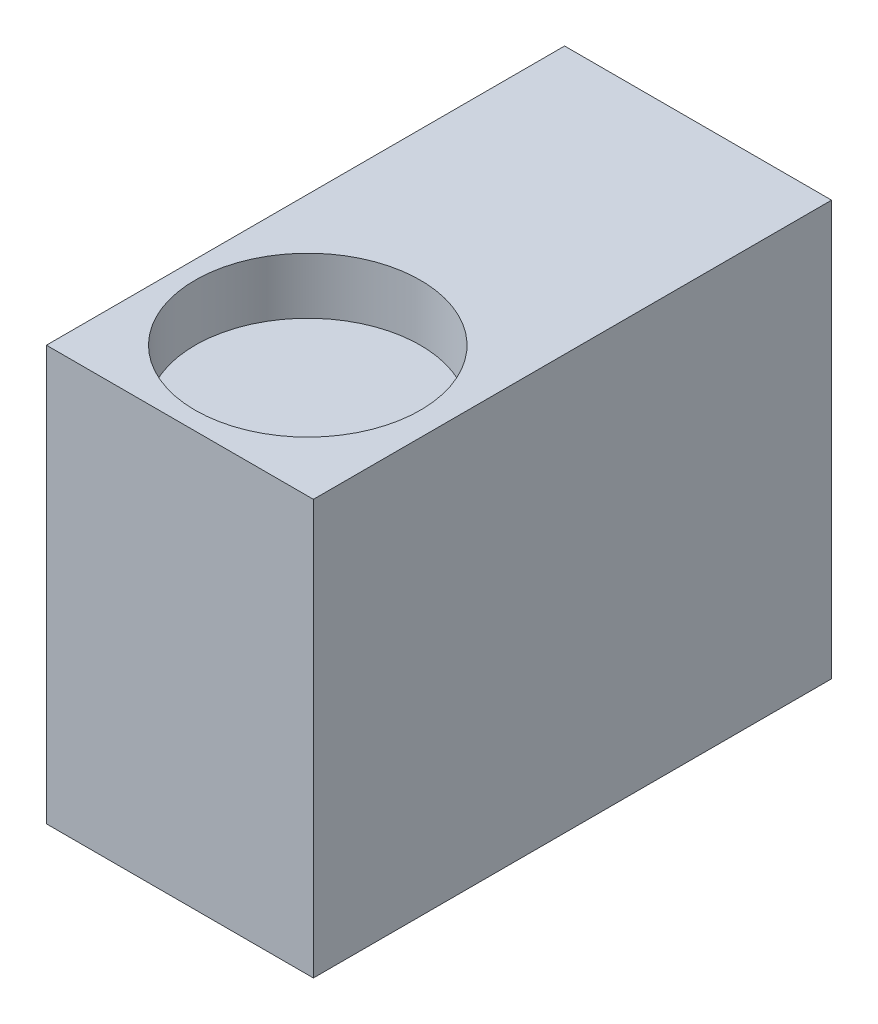
ISO-10303-21;
HEADER;
FILE_DESCRIPTION(('STEP AP214'),'2;1');
FILE_NAME('part.step','',(''),(''),'','','');
FILE_SCHEMA(('AUTOMOTIVE_DESIGN { 1 0 10303 214 1 1 1 1 }'));
ENDSEC;
DATA;
#1=APPLICATION_CONTEXT('core data for automotive mechanical design processes');
#2=APPLICATION_PROTOCOL_DEFINITION('international standard','automotive_design',2000,#1);
#3=PRODUCT_CONTEXT('',#1,'mechanical');
#4=PRODUCT('Part','Part','',(#3));
#5=PRODUCT_RELATED_PRODUCT_CATEGORY('part','',(#4));
#6=PRODUCT_DEFINITION_FORMATION('','',#4);
#7=PRODUCT_DEFINITION_CONTEXT('part definition',#1,'design');
#8=PRODUCT_DEFINITION('design','',#6,#7);
#9=PRODUCT_DEFINITION_SHAPE('','',#8);
#10=(LENGTH_UNIT() NAMED_UNIT(*) SI_UNIT(.MILLI.,.METRE.));
#11=(NAMED_UNIT(*) PLANE_ANGLE_UNIT() SI_UNIT($,.RADIAN.));
#12=(NAMED_UNIT(*) SI_UNIT($,.STERADIAN.) SOLID_ANGLE_UNIT());
#13=UNCERTAINTY_MEASURE_WITH_UNIT(LENGTH_MEASURE(1.E-05),#10,'distance_accuracy_value','');
#14=(GEOMETRIC_REPRESENTATION_CONTEXT(3) GLOBAL_UNCERTAINTY_ASSIGNED_CONTEXT((#13)) GLOBAL_UNIT_ASSIGNED_CONTEXT((#10,
#11,#12)) REPRESENTATION_CONTEXT('',''));
#15=CARTESIAN_POINT('',(0.,0.,0.));
#16=DIRECTION('',(0.,0.,1.));
#17=DIRECTION('',(1.,0.,0.));
#18=AXIS2_PLACEMENT_3D('',#15,#16,#17);
#19=CARTESIAN_POINT('',(-14.6078968253968,14.1813888888889,46.));
#20=DIRECTION('',(1.,0.,0.));
#21=DIRECTION('',(0.,1.,0.));
#22=AXIS2_PLACEMENT_3D('',#19,#20,#21);
#23=PLANE('',#22);
#24=DIRECTION('',(0.,-1.,0.));
#25=VECTOR('',#24,1.);
#26=CARTESIAN_POINT('',(-14.6078968253968,14.1813888888889,0.));
#27=LINE('',#26,#25);
#28=CARTESIAN_POINT('',(-14.6078968253968,14.1813888888889,0.));
#29=VERTEX_POINT('',#28);
#30=CARTESIAN_POINT('',(-14.6078968253968,-22.6186111111111,0.));
#31=VERTEX_POINT('',#30);
#32=EDGE_CURVE('E102',#29,#31,#27,.T.);
#33=ORIENTED_EDGE('',*,*,#32,.T.);
#34=DIRECTION('',(0.,0.,-1.));
#35=VECTOR('',#34,1.);
#36=CARTESIAN_POINT('',(-14.6078968253968,-22.6186111111111,46.));
#37=LINE('',#36,#35);
#38=CARTESIAN_POINT('',(-14.6078968253968,-22.6186111111111,46.));
#39=VERTEX_POINT('',#38);
#40=EDGE_CURVE('E11',#39,#31,#37,.T.);
#41=ORIENTED_EDGE('',*,*,#40,.F.);
#42=DIRECTION('',(0.,-1.,0.));
#43=VECTOR('',#42,1.);
#44=CARTESIAN_POINT('',(-14.6078968253968,14.1813888888889,46.));
#45=LINE('',#44,#43);
#46=CARTESIAN_POINT('',(-14.6078968253968,14.1813888888889,46.));
#47=VERTEX_POINT('',#46);
#48=EDGE_CURVE('E90',#47,#39,#45,.T.);
#49=ORIENTED_EDGE('',*,*,#48,.F.);
#50=DIRECTION('',(0.,0.,-1.));
#51=VECTOR('',#50,1.);
#52=CARTESIAN_POINT('',(-14.6078968253968,14.1813888888889,46.));
#53=LINE('',#52,#51);
#54=EDGE_CURVE('E98',#47,#29,#53,.T.);
#55=ORIENTED_EDGE('',*,*,#54,.T.);
#56=EDGE_LOOP('',(#33,#41,#49,#55));
#57=FACE_BOUND('',#56,.T.);
#58=ADVANCED_FACE('F39',(#57),#23,.F.);
#59=CARTESIAN_POINT('',(-14.6078968253968,-22.6186111111111,46.));
#60=DIRECTION('',(0.,1.,0.));
#61=DIRECTION('',(0.,0.,1.));
#62=AXIS2_PLACEMENT_3D('',#59,#60,#61);
#63=PLANE('',#62);
#64=CARTESIAN_POINT('',(-3.00789682539683,-22.6186111111111,34.4));
#65=DIRECTION('',(0.,1.,0.));
#66=DIRECTION('',(0.,0.,1.));
#67=AXIS2_PLACEMENT_3D('',#64,#65,#66);
#68=CIRCLE('',#67,10.);
#69=CARTESIAN_POINT('',(-3.00789682539683,-22.6186111111111,44.4));
#70=VERTEX_POINT('',#69);
#71=EDGE_CURVE('E122',#70,#70,#68,.T.);
#72=ORIENTED_EDGE('',*,*,#71,.T.);
#73=EDGE_LOOP('',(#72));
#74=FACE_BOUND('',#73,.T.);
#75=DIRECTION('',(1.,0.,0.));
#76=VECTOR('',#75,1.);
#77=CARTESIAN_POINT('',(-14.6078968253968,-22.6186111111111,0.));
#78=LINE('',#77,#76);
#79=CARTESIAN_POINT('',(9.09210317460317,-22.6186111111111,0.));
#80=VERTEX_POINT('',#79);
#81=EDGE_CURVE('E94',#31,#80,#78,.T.);
#82=ORIENTED_EDGE('',*,*,#81,.T.);
#83=DIRECTION('',(0.,0.,-1.));
#84=VECTOR('',#83,1.);
#85=CARTESIAN_POINT('',(9.09210317460317,-22.6186111111111,46.));
#86=LINE('',#85,#84);
#87=CARTESIAN_POINT('',(9.09210317460317,-22.6186111111111,46.));
#88=VERTEX_POINT('',#87);
#89=EDGE_CURVE('E47',#88,#80,#86,.T.);
#90=ORIENTED_EDGE('',*,*,#89,.F.);
#91=DIRECTION('',(1.,0.,0.));
#92=VECTOR('',#91,1.);
#93=CARTESIAN_POINT('',(-14.6078968253968,-22.6186111111111,46.));
#94=LINE('',#93,#92);
#95=EDGE_CURVE('E85',#39,#88,#94,.T.);
#96=ORIENTED_EDGE('',*,*,#95,.F.);
#97=ORIENTED_EDGE('',*,*,#40,.T.);
#98=EDGE_LOOP('',(#82,#90,#96,#97));
#99=FACE_BOUND('',#98,.T.);
#100=ADVANCED_FACE('F93',(#74,#99),#63,.F.);
#101=CARTESIAN_POINT('',(9.09210317460317,14.1813888888889,46.));
#102=DIRECTION('',(-1.,0.,0.));
#103=DIRECTION('',(0.,-1.,0.));
#104=AXIS2_PLACEMENT_3D('',#101,#102,#103);
#105=PLANE('',#104);
#106=DIRECTION('',(0.,1.,0.));
#107=VECTOR('',#106,1.);
#108=CARTESIAN_POINT('',(9.09210317460317,14.1813888888889,0.));
#109=LINE('',#108,#107);
#110=CARTESIAN_POINT('',(9.09210317460317,14.1813888888889,0.));
#111=VERTEX_POINT('',#110);
#112=EDGE_CURVE('E72',#80,#111,#109,.T.);
#113=ORIENTED_EDGE('',*,*,#112,.T.);
#114=DIRECTION('',(0.,0.,-1.));
#115=VECTOR('',#114,1.);
#116=CARTESIAN_POINT('',(9.09210317460317,14.1813888888889,46.));
#117=LINE('',#116,#115);
#118=CARTESIAN_POINT('',(9.09210317460317,14.1813888888889,46.));
#119=VERTEX_POINT('',#118);
#120=EDGE_CURVE('E95',#119,#111,#117,.T.);
#121=ORIENTED_EDGE('',*,*,#120,.F.);
#122=DIRECTION('',(0.,1.,0.));
#123=VECTOR('',#122,1.);
#124=CARTESIAN_POINT('',(9.09210317460317,14.1813888888889,46.));
#125=LINE('',#124,#123);
#126=EDGE_CURVE('E88',#88,#119,#125,.T.);
#127=ORIENTED_EDGE('',*,*,#126,.F.);
#128=ORIENTED_EDGE('',*,*,#89,.T.);
#129=EDGE_LOOP('',(#113,#121,#127,#128));
#130=FACE_BOUND('',#129,.T.);
#131=ADVANCED_FACE('F96',(#130),#105,.F.);
#132=CARTESIAN_POINT('',(-14.6078968253968,14.1813888888889,46.));
#133=DIRECTION('',(0.,-1.,0.));
#134=DIRECTION('',(0.,0.,-1.));
#135=AXIS2_PLACEMENT_3D('',#132,#133,#134);
#136=PLANE('',#135);
#137=CARTESIAN_POINT('',(-3.00789682539683,14.1813888888889,34.4));
#138=DIRECTION('',(0.,1.,0.));
#139=DIRECTION('',(0.,0.,1.));
#140=AXIS2_PLACEMENT_3D('',#137,#138,#139);
#141=CIRCLE('',#140,10.);
#142=CARTESIAN_POINT('',(-3.00789682539683,14.1813888888889,44.4));
#143=VERTEX_POINT('',#142);
#144=EDGE_CURVE('E116',#143,#143,#141,.T.);
#145=ORIENTED_EDGE('',*,*,#144,.F.);
#146=EDGE_LOOP('',(#145));
#147=FACE_BOUND('',#146,.T.);
#148=DIRECTION('',(-1.,0.,0.));
#149=VECTOR('',#148,1.);
#150=CARTESIAN_POINT('',(-14.6078968253968,14.1813888888889,0.));
#151=LINE('',#150,#149);
#152=EDGE_CURVE('E78',#111,#29,#151,.T.);
#153=ORIENTED_EDGE('',*,*,#152,.T.);
#154=ORIENTED_EDGE('',*,*,#54,.F.);
#155=DIRECTION('',(-1.,0.,0.));
#156=VECTOR('',#155,1.);
#157=CARTESIAN_POINT('',(-14.6078968253968,14.1813888888889,46.));
#158=LINE('',#157,#156);
#159=EDGE_CURVE('E55',#119,#47,#158,.T.);
#160=ORIENTED_EDGE('',*,*,#159,.F.);
#161=ORIENTED_EDGE('',*,*,#120,.T.);
#162=EDGE_LOOP('',(#153,#154,#160,#161));
#163=FACE_BOUND('',#162,.T.);
#164=ADVANCED_FACE('F110',(#147,#163),#136,.F.);
#165=CARTESIAN_POINT('',(0.,0.,46.));
#166=DIRECTION('',(0.,0.,1.));
#167=DIRECTION('',(1.,0.,0.));
#168=AXIS2_PLACEMENT_3D('',#165,#166,#167);
#169=PLANE('',#168);
#170=ORIENTED_EDGE('',*,*,#48,.T.);
#171=ORIENTED_EDGE('',*,*,#95,.T.);
#172=ORIENTED_EDGE('',*,*,#126,.T.);
#173=ORIENTED_EDGE('',*,*,#159,.T.);
#174=EDGE_LOOP('',(#170,#171,#172,#173));
#175=FACE_BOUND('',#174,.T.);
#176=ADVANCED_FACE('F86',(#175),#169,.T.);
#177=CARTESIAN_POINT('',(0.,0.,0.));
#178=DIRECTION('',(0.,0.,1.));
#179=DIRECTION('',(1.,0.,0.));
#180=AXIS2_PLACEMENT_3D('',#177,#178,#179);
#181=PLANE('',#180);
#182=ORIENTED_EDGE('',*,*,#32,.F.);
#183=ORIENTED_EDGE('',*,*,#152,.F.);
#184=ORIENTED_EDGE('',*,*,#112,.F.);
#185=ORIENTED_EDGE('',*,*,#81,.F.);
#186=EDGE_LOOP('',(#182,#183,#184,#185));
#187=FACE_BOUND('',#186,.T.);
#188=ADVANCED_FACE('F113',(#187),#181,.F.);
#189=CARTESIAN_POINT('',(-3.00789682539683,9.18138888888889,34.4));
#190=DIRECTION('',(0.,1.,0.));
#191=DIRECTION('',(0.,0.,1.));
#192=AXIS2_PLACEMENT_3D('',#189,#190,#191);
#193=CYLINDRICAL_SURFACE('',#192,10.);
#194=CARTESIAN_POINT('',(-3.00789682539683,9.18138888888889,34.4));
#195=DIRECTION('',(0.,1.,0.));
#196=DIRECTION('',(0.,0.,1.));
#197=AXIS2_PLACEMENT_3D('',#194,#195,#196);
#198=CIRCLE('',#197,10.);
#199=CARTESIAN_POINT('',(-3.00789682539683,9.18138888888889,44.4));
#200=VERTEX_POINT('',#199);
#201=EDGE_CURVE('E105',#200,#200,#198,.T.);
#202=ORIENTED_EDGE('',*,*,#201,.F.);
#203=EDGE_LOOP('',(#202));
#204=FACE_BOUND('',#203,.T.);
#205=ORIENTED_EDGE('',*,*,#144,.T.);
#206=EDGE_LOOP('',(#205));
#207=FACE_BOUND('',#206,.T.);
#208=ADVANCED_FACE('F154',(#204,#207),#193,.F.);
#209=CARTESIAN_POINT('',(-3.00789682539683,9.18138888888889,34.4));
#210=DIRECTION('',(0.,1.,0.));
#211=DIRECTION('',(0.,0.,1.));
#212=AXIS2_PLACEMENT_3D('',#209,#210,#211);
#213=PLANE('',#212);
#214=ORIENTED_EDGE('',*,*,#201,.T.);
#215=EDGE_LOOP('',(#214));
#216=FACE_BOUND('',#215,.T.);
#217=ADVANCED_FACE('F137',(#216),#213,.T.);
#218=CARTESIAN_POINT('',(-3.00789682539683,-17.6186111111111,34.4));
#219=DIRECTION('',(0.,-1.,0.));
#220=DIRECTION('',(0.,0.,-1.));
#221=AXIS2_PLACEMENT_3D('',#218,#219,#220);
#222=CYLINDRICAL_SURFACE('',#221,10.);
#223=CARTESIAN_POINT('',(-3.00789682539683,-17.6186111111111,34.4));
#224=DIRECTION('',(0.,1.,0.));
#225=DIRECTION('',(0.,0.,1.));
#226=AXIS2_PLACEMENT_3D('',#223,#224,#225);
#227=CIRCLE('',#226,10.);
#228=CARTESIAN_POINT('',(-3.00789682539683,-17.6186111111111,44.4));
#229=VERTEX_POINT('',#228);
#230=EDGE_CURVE('E119',#229,#229,#227,.T.);
#231=ORIENTED_EDGE('',*,*,#230,.T.);
#232=EDGE_LOOP('',(#231));
#233=FACE_BOUND('',#232,.T.);
#234=ORIENTED_EDGE('',*,*,#71,.F.);
#235=EDGE_LOOP('',(#234));
#236=FACE_BOUND('',#235,.T.);
#237=ADVANCED_FACE('F128',(#233,#236),#222,.F.);
#238=CARTESIAN_POINT('',(-3.00789682539683,-17.6186111111111,34.4));
#239=DIRECTION('',(0.,-1.,0.));
#240=DIRECTION('',(0.,0.,1.));
#241=AXIS2_PLACEMENT_3D('',#238,#239,#240);
#242=PLANE('',#241);
#243=ORIENTED_EDGE('',*,*,#230,.F.);
#244=EDGE_LOOP('',(#243));
#245=FACE_BOUND('',#244,.T.);
#246=ADVANCED_FACE('F131',(#245),#242,.T.);
#247=CLOSED_SHELL('',(#58,#100,#131,#164,#176,#188,#208,#217,#237,#246));
#248=MANIFOLD_SOLID_BREP('B2',#247);
#249=ADVANCED_BREP_SHAPE_REPRESENTATION('',(#18,#248),#14);
#250=SHAPE_DEFINITION_REPRESENTATION(#9,#249);
ENDSEC;
END-ISO-10303-21;
